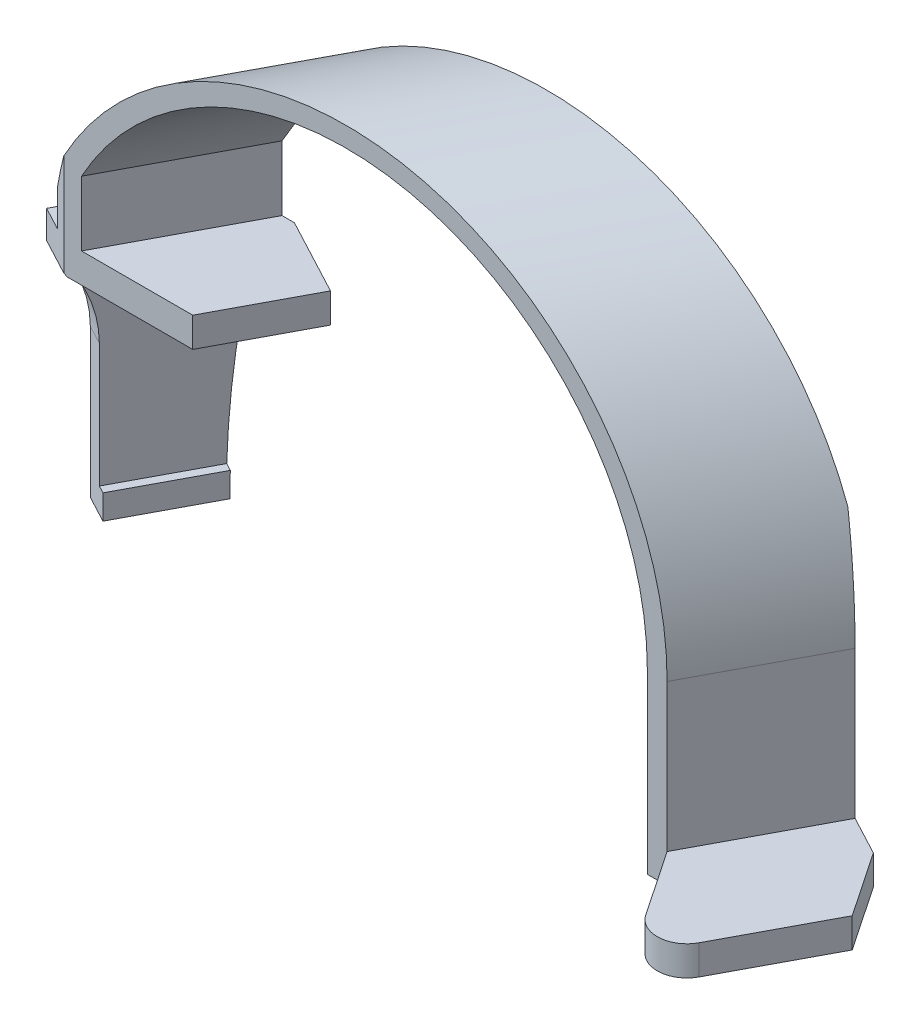
ISO-10303-21;
HEADER;
FILE_DESCRIPTION(('STEP AP214'),'2;1');
FILE_NAME('part.step','',(''),(''),'','','');
FILE_SCHEMA(('AUTOMOTIVE_DESIGN { 1 0 10303 214 1 1 1 1 }'));
ENDSEC;
DATA;
#1=APPLICATION_CONTEXT('core data for automotive mechanical design processes');
#2=APPLICATION_PROTOCOL_DEFINITION('international standard','automotive_design',2000,#1);
#3=PRODUCT_CONTEXT('',#1,'mechanical');
#4=PRODUCT('Part','Part','',(#3));
#5=PRODUCT_RELATED_PRODUCT_CATEGORY('part','',(#4));
#6=PRODUCT_DEFINITION_FORMATION('','',#4);
#7=PRODUCT_DEFINITION_CONTEXT('part definition',#1,'design');
#8=PRODUCT_DEFINITION('design','',#6,#7);
#9=PRODUCT_DEFINITION_SHAPE('','',#8);
#10=(LENGTH_UNIT() NAMED_UNIT(*) SI_UNIT(.MILLI.,.METRE.));
#11=(NAMED_UNIT(*) PLANE_ANGLE_UNIT() SI_UNIT($,.RADIAN.));
#12=(NAMED_UNIT(*) SI_UNIT($,.STERADIAN.) SOLID_ANGLE_UNIT());
#13=UNCERTAINTY_MEASURE_WITH_UNIT(LENGTH_MEASURE(1.E-05),#10,'distance_accuracy_value','');
#14=(GEOMETRIC_REPRESENTATION_CONTEXT(3) GLOBAL_UNCERTAINTY_ASSIGNED_CONTEXT((#13)) GLOBAL_UNIT_ASSIGNED_CONTEXT((#10,
#11,#12)) REPRESENTATION_CONTEXT('',''));
#15=CARTESIAN_POINT('',(0.,0.,0.));
#16=DIRECTION('',(0.,0.,1.));
#17=DIRECTION('',(1.,0.,0.));
#18=AXIS2_PLACEMENT_3D('',#15,#16,#17);
#19=CARTESIAN_POINT('',(-7.04207344178837,0.,13.2442138928839));
#20=DIRECTION('',(0.,0.,1.));
#21=DIRECTION('',(-1.,0.,0.));
#22=AXIS2_PLACEMENT_3D('',#19,#20,#21);
#23=PLANE('',#22);
#24=DIRECTION('',(0.,1.,0.));
#25=VECTOR('',#24,1.);
#26=CARTESIAN_POINT('',(25.4579265582116,-34.7865111003914,13.2442138928839));
#27=LINE('',#26,#25);
#28=CARTESIAN_POINT('',(25.4579265582116,-17.9,13.2442138928839));
#29=VERTEX_POINT('',#28);
#30=CARTESIAN_POINT('',(25.4579265582116,-14.9,13.2442138928839));
#31=VERTEX_POINT('',#30);
#32=EDGE_CURVE('E217',#29,#31,#27,.T.);
#33=ORIENTED_EDGE('',*,*,#32,.T.);
#34=DIRECTION('',(0.,1.,0.));
#35=VECTOR('',#34,1.);
#36=CARTESIAN_POINT('',(25.4579265582116,-14.9,13.2442138928839));
#37=LINE('',#36,#35);
#38=CARTESIAN_POINT('',(25.4579265582116,0.,13.2442138928839));
#39=VERTEX_POINT('',#38);
#40=EDGE_CURVE('E230',#31,#39,#37,.T.);
#41=ORIENTED_EDGE('',*,*,#40,.T.);
#42=CARTESIAN_POINT('',(-7.04207344178837,0.,13.2442138928839));
#43=DIRECTION('',(0.,0.,1.));
#44=DIRECTION('',(-1.,0.,0.));
#45=AXIS2_PLACEMENT_3D('',#42,#43,#44);
#46=CIRCLE('',#45,32.5);
#47=CARTESIAN_POINT('',(-35.5880298672367,15.5363564504811,13.2442138928839));
#48=VERTEX_POINT('',#47);
#49=EDGE_CURVE('E423',#39,#48,#46,.T.);
#50=ORIENTED_EDGE('',*,*,#49,.T.);
#51=DIRECTION('',(0.,1.,0.));
#52=VECTOR('',#51,1.);
#53=CARTESIAN_POINT('',(-35.5880298672367,0.,13.2442138928839));
#54=LINE('',#53,#52);
#55=CARTESIAN_POINT('',(-35.5880298672367,5.26788060441782,13.2442138928839));
#56=VERTEX_POINT('',#55);
#57=EDGE_CURVE('E263',#56,#48,#54,.T.);
#58=ORIENTED_EDGE('',*,*,#57,.F.);
#59=CARTESIAN_POINT('',(-53.8485551832628,-2.90000000000001,13.2442138928839));
#60=DIRECTION('',(0.,0.,-1.));
#61=DIRECTION('',(-1.,0.,0.));
#62=AXIS2_PLACEMENT_3D('',#59,#60,#61);
#63=ELLIPSE('',#62,25.2217813165167,11.8409090909091);
#64=CARTESIAN_POINT('',(-35.2538838395383,5.1,13.2442138928839));
#65=VERTEX_POINT('',#64);
#66=EDGE_CURVE('E497',#56,#65,#63,.T.);
#67=ORIENTED_EDGE('',*,*,#66,.T.);
#68=DIRECTION('',(1.,0.,0.));
#69=VECTOR('',#68,1.);
#70=CARTESIAN_POINT('',(-37.8420734417884,5.1,13.2442138928839));
#71=LINE('',#70,#69);
#72=CARTESIAN_POINT('',(-33.7920734417884,5.1,13.2442138928839));
#73=VERTEX_POINT('',#72);
#74=EDGE_CURVE('E521',#65,#73,#71,.T.);
#75=ORIENTED_EDGE('',*,*,#74,.T.);
#76=DIRECTION('',(1.,0.,0.));
#77=VECTOR('',#76,1.);
#78=CARTESIAN_POINT('',(-33.7920734417884,5.1,13.2442138928839));
#79=LINE('',#78,#77);
#80=CARTESIAN_POINT('',(-22.5420734417884,5.1,13.2442138928839));
#81=VERTEX_POINT('',#80);
#82=EDGE_CURVE('E529',#73,#81,#79,.T.);
#83=ORIENTED_EDGE('',*,*,#82,.T.);
#84=DIRECTION('',(0.,1.,0.));
#85=VECTOR('',#84,1.);
#86=CARTESIAN_POINT('',(-22.5420734417884,5.1,13.2442138928839));
#87=LINE('',#86,#85);
#88=CARTESIAN_POINT('',(-22.5420734417884,8.1,13.2442138928839));
#89=VERTEX_POINT('',#88);
#90=EDGE_CURVE('E537',#81,#89,#87,.T.);
#91=ORIENTED_EDGE('',*,*,#90,.T.);
#92=DIRECTION('',(-1.,0.,0.));
#93=VECTOR('',#92,1.);
#94=CARTESIAN_POINT('',(-22.5420734417884,8.1,13.2442138928839));
#95=LINE('',#94,#93);
#96=CARTESIAN_POINT('',(-33.7920734417884,8.09999999999999,13.2442138928839));
#97=VERTEX_POINT('',#96);
#98=EDGE_CURVE('E542',#89,#97,#95,.T.);
#99=ORIENTED_EDGE('',*,*,#98,.T.);
#100=DIRECTION('',(0.,1.,0.));
#101=VECTOR('',#100,1.);
#102=CARTESIAN_POINT('',(-33.7920734417884,8.09999999999999,13.2442138928839));
#103=LINE('',#102,#101);
#104=CARTESIAN_POINT('',(-33.7920734417884,14.6522182620926,13.2442138928839));
#105=VERTEX_POINT('',#104);
#106=EDGE_CURVE('E550',#97,#105,#103,.T.);
#107=ORIENTED_EDGE('',*,*,#106,.T.);
#108=CARTESIAN_POINT('',(-7.04207344178837,0.,13.2442138928839));
#109=DIRECTION('',(0.,0.,-1.));
#110=DIRECTION('',(-1.,0.,0.));
#111=AXIS2_PLACEMENT_3D('',#108,#109,#110);
#112=CIRCLE('',#111,30.5);
#113=CARTESIAN_POINT('',(23.4579265582116,0.,13.2442138928839));
#114=VERTEX_POINT('',#113);
#115=EDGE_CURVE('E558',#105,#114,#112,.T.);
#116=ORIENTED_EDGE('',*,*,#115,.T.);
#117=DIRECTION('',(0.,-1.,0.));
#118=VECTOR('',#117,1.);
#119=CARTESIAN_POINT('',(23.4579265582116,0.,13.2442138928839));
#120=LINE('',#119,#118);
#121=CARTESIAN_POINT('',(23.4579265582116,-17.9,13.2442138928839));
#122=VERTEX_POINT('',#121);
#123=EDGE_CURVE('E565',#114,#122,#120,.T.);
#124=ORIENTED_EDGE('',*,*,#123,.T.);
#125=DIRECTION('',(1.,0.,0.));
#126=VECTOR('',#125,1.);
#127=CARTESIAN_POINT('',(38.4579265582116,-17.9,13.2442138928839));
#128=LINE('',#127,#126);
#129=EDGE_CURVE('E244',#122,#29,#128,.T.);
#130=ORIENTED_EDGE('',*,*,#129,.T.);
#131=EDGE_LOOP('',(#33,#41,#50,#58,#67,#75,#83,#91,#99,#107,#116,#124,#130));
#132=FACE_BOUND('',#131,.T.);
#133=ADVANCED_FACE('F35',(#132),#23,.T.);
#134=CARTESIAN_POINT('',(32.5,0.,0.));
#135=CARTESIAN_POINT('',(25.4579265582116,0.,13.2442138928839));
#136=CARTESIAN_POINT('',(32.5,46.5453658776146,0.));
#137=CARTESIAN_POINT('',(25.4579265582116,46.5453658776146,13.2442138928839));
#138=CARTESIAN_POINT('',(-13.2326781943357,55.2052290320959,0.));
#139=CARTESIAN_POINT('',(-20.274751636124,55.2052290320959,13.2442138928839));
#140=CARTESIAN_POINT('',(-30.25,11.8822346383162,0.));
#141=CARTESIAN_POINT('',(-37.2920734417884,11.8822346383162,13.2442138928839));
#142=(BOUNDED_SURFACE() B_SPLINE_SURFACE(3,1,((#134,#135),(#136,#137),(#138,#139),(#140,#141)),
.UNSPECIFIED.,.F.,.F.,.F.) B_SPLINE_SURFACE_WITH_KNOTS((4,4),(2,2),(0.,1.),(0.,1.),
.UNSPECIFIED.) GEOMETRIC_REPRESENTATION_ITEM() RATIONAL_B_SPLINE_SURFACE(((1.,1.),
(0.457368067922542,0.457368067922542),(0.457368067922542,0.457368067922542),(1.,1.))) REPRESENTATION_ITEM('') SURFACE());
#143=CARTESIAN_POINT('',(-36.9164961915597,11.8822346383162,12.5378558185968));
#144=CARTESIAN_POINT('',(-36.8687982856735,12.0379949890474,12.5632172450269));
#145=CARTESIAN_POINT('',(-36.8201339475619,12.1933758630278,12.5890925325864));
#146=CARTESIAN_POINT('',(-36.720905244315,12.5032509034758,12.6418533699943));
#147=CARTESIAN_POINT('',(-36.6703420481109,12.6577455500996,12.668738298311));
#148=CARTESIAN_POINT('',(-36.5673116330772,12.9658464892543,12.7235205417324));
#149=CARTESIAN_POINT('',(-36.514845197407,13.1194531176933,12.7514174404239));
#150=CARTESIAN_POINT('',(-36.4080029551091,13.4257757019607,12.8082264683536));
#151=CARTESIAN_POINT('',(-36.3536275438921,13.5784918346865,12.8371383873482));
#152=CARTESIAN_POINT('',(-36.242960069378,13.8830318573129,12.8959813273255));
#153=CARTESIAN_POINT('',(-36.1866679941199,14.0348557416385,12.925912354668));
#154=CARTESIAN_POINT('',(-36.0721595520628,14.3376059722232,12.9867975733146));
#155=CARTESIAN_POINT('',(-36.0139428008037,14.4885321319677,13.0177519690398));
#156=CARTESIAN_POINT('',(-35.8955755034144,14.7894821608153,13.0806889774619));
#157=CARTESIAN_POINT('',(-35.835424181289,14.9395056384545,13.1126720027629));
#158=CARTESIAN_POINT('',(-35.7131768580037,15.2386447351217,13.177672057549));
#159=CARTESIAN_POINT('',(-35.6510796845373,15.3877597396114,13.2106897103606));
#160=CARTESIAN_POINT('',(-35.5880298672367,15.5363564504811,13.2442138928839));
#161=B_SPLINE_CURVE_WITH_KNOTS('',3,(#143,#144,#145,#146,#147,#148,#149,#150,#151,#152,#153,
#154,#155,#156,#157,#158,#159,#160),.UNSPECIFIED.,.F.,.F.,(4,2,2,2,2,2,2,2,4),(0.,
0.494583032251077,0.988866437212226,1.48294870785065,1.97692923492772,2.4709128452541,
2.96499573373384,3.45927934315677,3.95386669383938),.UNSPECIFIED.);
#162=CARTESIAN_POINT('',(-36.9164961915597,11.8822346383162,12.5378558185968));
#163=VERTEX_POINT('',#162);
#164=EDGE_CURVE('E255',#163,#48,#161,.T.);
#165=DIRECTION('',(-0.469471562785892,0.,0.882947592858926));
#166=VECTOR('',#165,1.);
#167=CARTESIAN_POINT('',(32.5,0.,0.));
#168=LINE('',#167,#166);
#169=CARTESIAN_POINT('',(32.0591929034708,0.,0.829037572555032));
#170=VERTEX_POINT('',#169);
#171=EDGE_CURVE('E236',#170,#39,#168,.T.);
#172=CARTESIAN_POINT('',(30.5,11.2249721603217,0.));
#173=CARTESIAN_POINT('',(30.5870300877948,10.9216438047626,0.0462747185188256));
#174=CARTESIAN_POINT('',(30.6704364276544,10.6169834846295,0.0906226560825374));
#175=CARTESIAN_POINT('',(30.8297133460518,10.0062889779655,0.175311695840425));
#176=CARTESIAN_POINT('',(30.9056089310888,9.70026315792595,0.215666094226057));
#177=CARTESIAN_POINT('',(31.0499792206244,9.08687043789797,0.292429138823825));
#178=CARTESIAN_POINT('',(31.1184736321463,8.77950948571191,0.328848263446127));
#179=CARTESIAN_POINT('',(31.2481363209366,8.16347236743959,0.397791138010515));
#180=CARTESIAN_POINT('',(31.309319207014,7.85480014475877,0.430322655594131));
#181=CARTESIAN_POINT('',(31.4244337380131,7.23616096360021,0.491530137447629));
#182=CARTESIAN_POINT('',(31.4783750436956,6.92619631049452,0.520211238435138));
#183=CARTESIAN_POINT('',(31.5790624388578,6.3049872616726,0.573747676092342));
#184=CARTESIAN_POINT('',(31.6258133405621,5.9937438662515,0.59860557146719));
#185=CARTESIAN_POINT('',(31.712154736267,5.37000739693937,0.644514105906288));
#186=CARTESIAN_POINT('',(31.7517457115576,5.05751440849034,0.66556500087697));
#187=CARTESIAN_POINT('',(31.8237919419099,4.43125077131639,0.703872661070926));
#188=CARTESIAN_POINT('',(31.8562421367813,4.11747937601429,0.721126735743343));
#189=CARTESIAN_POINT('',(31.914007354856,3.48865884379545,0.751841047015646));
#190=CARTESIAN_POINT('',(31.9393124962721,3.17360854265872,0.765296029376087));
#191=CARTESIAN_POINT('',(31.9827697650184,2.54222820401616,0.788402669042736));
#192=CARTESIAN_POINT('',(32.0009071713295,2.22589686698319,0.798046499044231));
#193=CARTESIAN_POINT('',(32.0299926121239,1.59195057334708,0.813511502238647));
#194=CARTESIAN_POINT('',(32.0409210206188,1.27433446187131,0.819322240108433));
#195=CARTESIAN_POINT('',(32.0555335570521,0.63781269376178,0.827091863550531));
#196=CARTESIAN_POINT('',(32.0591930396647,0.318906311124735,0.829037644970639));
#197=CARTESIAN_POINT('',(32.0591929034708,0.,0.829037572555029));
#198=B_SPLINE_CURVE_WITH_KNOTS('',3,(#172,#173,#174,#175,#176,#177,#178,#179,#180,#181,#182,
#183,#184,#185,#186,#187,#188,#189,#190,#191,#192,#193,#194,#195,#196,#197),.UNSPECIFIED.,.F.,
.F.,(4,2,2,2,2,2,2,2,2,2,2,2,4),(0.,0.956792913563713,1.91028477245361,2.86117173935745,
3.81012584023216,4.75780111745014,5.70483937084619,6.65181394068355,7.59945742195184,
8.54840516897329,9.49929185052377,10.4527566859828,11.4094487674815),.UNSPECIFIED.);
#199=CARTESIAN_POINT('',(30.5,11.2249721603218,0.));
#200=VERTEX_POINT('',#199);
#201=EDGE_CURVE('E287',#200,#170,#198,.T.);
#202=CARTESIAN_POINT('',(0.,0.,0.));
#203=DIRECTION('',(0.,0.,1.));
#204=DIRECTION('',(-1.,0.,0.));
#205=AXIS2_PLACEMENT_3D('',#202,#203,#204);
#206=CIRCLE('',#205,32.5);
#207=CARTESIAN_POINT('',(-30.25,11.8822346383162,0.));
#208=VERTEX_POINT('',#207);
#209=EDGE_CURVE('E424',#200,#208,#206,.T.);
#210=DIRECTION('',(-0.469471562785892,0.,0.882947592858926));
#211=VECTOR('',#210,1.);
#212=CARTESIAN_POINT('',(-30.25,11.8822346383162,0.));
#213=LINE('',#212,#211);
#214=EDGE_CURVE('E430',#208,#163,#213,.T.);
#215=ORIENTED_EDGE('',*,*,#164,.T.);
#216=ORIENTED_EDGE('',*,*,#49,.F.);
#217=ORIENTED_EDGE('',*,*,#171,.F.);
#218=ORIENTED_EDGE('',*,*,#201,.F.);
#219=ORIENTED_EDGE('',*,*,#209,.T.);
#220=ORIENTED_EDGE('',*,*,#214,.T.);
#221=EDGE_LOOP('',(#215,#216,#217,#218,#219,#220));
#222=FACE_BOUND('',#221,.T.);
#223=ADVANCED_FACE('F269',(#222),#142,.T.);
#224=CARTESIAN_POINT('',(-30.25,8.09999999999999,0.));
#225=DIRECTION('',(0.882947592858927,0.,0.469471562785892));
#226=DIRECTION('',(-0.469471562785892,0.,0.882947592858927));
#227=AXIS2_PLACEMENT_3D('',#224,#225,#226);
#228=PLANE('',#227);
#229=DIRECTION('',(0.,1.,0.));
#230=VECTOR('',#229,1.);
#231=CARTESIAN_POINT('',(-36.9164961915597,8.09999999999999,12.5378558185968));
#232=LINE('',#231,#230);
#233=CARTESIAN_POINT('',(-36.9164961915597,8.09999999999999,12.5378558185967));
#234=VERTEX_POINT('',#233);
#235=EDGE_CURVE('E253',#234,#163,#232,.T.);
#236=ORIENTED_EDGE('',*,*,#235,.T.);
#237=ORIENTED_EDGE('',*,*,#214,.F.);
#238=DIRECTION('',(0.,-1.,0.));
#239=VECTOR('',#238,1.);
#240=CARTESIAN_POINT('',(-30.25,8.09999999999999,0.));
#241=LINE('',#240,#239);
#242=CARTESIAN_POINT('',(-30.25,8.09999999999999,0.));
#243=VERTEX_POINT('',#242);
#244=EDGE_CURVE('E427',#208,#243,#241,.T.);
#245=ORIENTED_EDGE('',*,*,#244,.T.);
#246=DIRECTION('',(-0.469471562785892,0.,0.882947592858926));
#247=VECTOR('',#246,1.);
#248=CARTESIAN_POINT('',(-30.25,8.09999999999999,0.));
#249=LINE('',#248,#247);
#250=EDGE_CURVE('E433',#243,#234,#249,.T.);
#251=ORIENTED_EDGE('',*,*,#250,.T.);
#252=EDGE_LOOP('',(#236,#237,#245,#251));
#253=FACE_BOUND('',#252,.T.);
#254=ADVANCED_FACE('F276',(#253),#228,.F.);
#255=CARTESIAN_POINT('',(-33.3,8.1,0.));
#256=DIRECTION('',(0.,-1.,0.));
#257=DIRECTION('',(1.,0.,0.));
#258=AXIS2_PLACEMENT_3D('',#255,#256,#257);
#259=PLANE('',#258);
#260=DIRECTION('',(0.882947592858927,0.,0.469471562785891));
#261=VECTOR('',#260,1.);
#262=CARTESIAN_POINT('',(-39.2942653693525,8.1,11.2735735204503));
#263=LINE('',#262,#261);
#264=CARTESIAN_POINT('',(-39.2942653693525,8.09999999999999,11.2735735204503));
#265=VERTEX_POINT('',#264);
#266=EDGE_CURVE('E251',#265,#234,#263,.T.);
#267=ORIENTED_EDGE('',*,*,#266,.T.);
#268=ORIENTED_EDGE('',*,*,#250,.F.);
#269=DIRECTION('',(-1.,0.,0.));
#270=VECTOR('',#269,1.);
#271=CARTESIAN_POINT('',(-33.3,8.1,0.));
#272=LINE('',#271,#270);
#273=CARTESIAN_POINT('',(-33.3,8.1,0.));
#274=VERTEX_POINT('',#273);
#275=EDGE_CURVE('E436',#243,#274,#272,.T.);
#276=ORIENTED_EDGE('',*,*,#275,.T.);
#277=DIRECTION('',(-0.469471562785892,0.,0.882947592858926));
#278=VECTOR('',#277,1.);
#279=CARTESIAN_POINT('',(-33.3,8.1,0.));
#280=LINE('',#279,#278);
#281=EDGE_CURVE('E439',#274,#265,#280,.T.);
#282=ORIENTED_EDGE('',*,*,#281,.T.);
#283=EDGE_LOOP('',(#267,#268,#276,#282));
#284=FACE_BOUND('',#283,.T.);
#285=ADVANCED_FACE('F596',(#284),#259,.F.);
#286=CARTESIAN_POINT('',(-33.3,-17.9,0.));
#287=DIRECTION('',(0.882947592858927,0.,0.469471562785892));
#288=DIRECTION('',(-0.469471562785892,0.,0.882947592858927));
#289=AXIS2_PLACEMENT_3D('',#286,#287,#288);
#290=PLANE('',#289);
#291=DIRECTION('',(0.,1.,0.));
#292=VECTOR('',#291,1.);
#293=CARTESIAN_POINT('',(-39.2942653693525,-17.9,11.2735735204503));
#294=LINE('',#293,#292);
#295=CARTESIAN_POINT('',(-39.2942653693525,5.26788060441782,11.2735735204503));
#296=VERTEX_POINT('',#295);
#297=EDGE_CURVE('E247',#296,#265,#294,.T.);
#298=ORIENTED_EDGE('',*,*,#297,.T.);
#299=ORIENTED_EDGE('',*,*,#281,.F.);
#300=DIRECTION('',(0.,-1.,0.));
#301=VECTOR('',#300,1.);
#302=CARTESIAN_POINT('',(-33.3,-17.9,0.));
#303=LINE('',#302,#301);
#304=CARTESIAN_POINT('',(-33.3,-17.9,0.));
#305=VERTEX_POINT('',#304);
#306=EDGE_CURVE('E442',#274,#305,#303,.T.);
#307=ORIENTED_EDGE('',*,*,#306,.T.);
#308=DIRECTION('',(-0.469471562785892,0.,0.882947592858926));
#309=VECTOR('',#308,1.);
#310=CARTESIAN_POINT('',(-33.3,-17.9,0.));
#311=LINE('',#310,#309);
#312=CARTESIAN_POINT('',(-37.759979846466,-17.9,8.38800213215979));
#313=VERTEX_POINT('',#312);
#314=EDGE_CURVE('E445',#305,#313,#311,.T.);
#315=ORIENTED_EDGE('',*,*,#314,.T.);
#316=DIRECTION('',(0.,1.,0.));
#317=VECTOR('',#316,1.);
#318=CARTESIAN_POINT('',(-37.759979846466,-17.9,8.38800213215979));
#319=LINE('',#318,#317);
#320=CARTESIAN_POINT('',(-37.759979846466,-2.9,8.3880021321598));
#321=VERTEX_POINT('',#320);
#322=EDGE_CURVE('E468',#313,#321,#319,.T.);
#323=ORIENTED_EDGE('',*,*,#322,.T.);
#324=CARTESIAN_POINT('',(-43.3189499421807,-2.90000000000001,18.8429043112394));
#325=DIRECTION('',(0.882947592858926,0.,0.469471562785892));
#326=DIRECTION('',(0.469471562785892,0.,-0.882947592858926));
#327=AXIS2_PLACEMENT_3D('',#324,#325,#326);
#328=CIRCLE('',#327,11.8409090909091);
#329=EDGE_CURVE('E470',#321,#296,#328,.T.);
#330=ORIENTED_EDGE('',*,*,#329,.T.);
#331=EDGE_LOOP('',(#298,#299,#307,#315,#323,#330));
#332=FACE_BOUND('',#331,.T.);
#333=ADVANCED_FACE('F586',(#332),#290,.F.);
#334=CARTESIAN_POINT('',(21.0258385599899,-2.90000000000001,53.0556352361067));
#335=DIRECTION('',(-0.882947592858927,0.,-0.469471562785892));
#336=DIRECTION('',(0.469471562785892,0.,-0.882947592858927));
#337=AXIS2_PLACEMENT_3D('',#334,#335,#336);
#338=CYLINDRICAL_SURFACE('',#337,11.8409090909091);
#339=DIRECTION('',(-0.882947592858927,0.,-0.469471562785892));
#340=VECTOR('',#339,1.);
#341=CARTESIAN_POINT('',(25.0505231328181,5.26788060441782,45.4863044453176));
#342=LINE('',#341,#340);
#343=EDGE_CURVE('E407',#56,#296,#342,.T.);
#344=ORIENTED_EDGE('',*,*,#343,.T.);
#345=ORIENTED_EDGE('',*,*,#329,.F.);
#346=DIRECTION('',(-0.882947592858927,0.,-0.469471562785892));
#347=VECTOR('',#346,1.);
#348=CARTESIAN_POINT('',(26.5848086557047,-2.9,42.6007330570271));
#349=LINE('',#348,#347);
#350=CARTESIAN_POINT('',(-35.8109887171276,-2.9,9.4242990978536));
#351=VERTEX_POINT('',#350);
#352=EDGE_CURVE('E469',#351,#321,#349,.T.);
#353=ORIENTED_EDGE('',*,*,#352,.F.);
#354=CARTESIAN_POINT('',(-41.3699588128423,-2.90000000000001,19.8792012769332));
#355=DIRECTION('',(0.882947592858926,0.,0.469471562785892));
#356=DIRECTION('',(0.469471562785892,0.,-0.882947592858927));
#357=AXIS2_PLACEMENT_3D('',#354,#355,#356);
#358=CIRCLE('',#357,11.8409090909091);
#359=CARTESIAN_POINT('',(-37.2716272698708,5.1,12.1713606803031));
#360=VERTEX_POINT('',#359);
#361=EDGE_CURVE('E494',#351,#360,#358,.T.);
#362=ORIENTED_EDGE('',*,*,#361,.T.);
#363=DIRECTION('',(-0.882947592858927,0.,-0.469471562785892));
#364=VECTOR('',#363,1.);
#365=CARTESIAN_POINT('',(25.1241701029614,5.1,45.3477946394766));
#366=LINE('',#365,#364);
#367=EDGE_CURVE('E492',#360,#65,#366,.F.);
#368=ORIENTED_EDGE('',*,*,#367,.T.);
#369=ORIENTED_EDGE('',*,*,#66,.F.);
#370=EDGE_LOOP('',(#344,#345,#353,#362,#368,#369));
#371=FACE_BOUND('',#370,.T.);
#372=ADVANCED_FACE('F378',(#371),#338,.F.);
#373=CARTESIAN_POINT('',(0.,0.,0.));
#374=DIRECTION('',(0.,0.,1.));
#375=DIRECTION('',(-1.,0.,0.));
#376=AXIS2_PLACEMENT_3D('',#373,#374,#375);
#377=PLANE('',#376);
#378=DIRECTION('',(1.,0.,0.));
#379=VECTOR('',#378,1.);
#380=CARTESIAN_POINT('',(-26.75,5.1,0.));
#381=LINE('',#380,#379);
#382=CARTESIAN_POINT('',(-26.75,5.1,0.));
#383=VERTEX_POINT('',#382);
#384=CARTESIAN_POINT('',(-25.5000000000001,5.1,0.));
#385=VERTEX_POINT('',#384);
#386=EDGE_CURVE('E524',#383,#385,#381,.T.);
#387=ORIENTED_EDGE('',*,*,#386,.F.);
#388=DIRECTION('',(1.,0.,0.));
#389=VECTOR('',#388,1.);
#390=CARTESIAN_POINT('',(-30.8,5.1,0.));
#391=LINE('',#390,#389);
#392=CARTESIAN_POINT('',(-30.8,5.1,0.));
#393=VERTEX_POINT('',#392);
#394=EDGE_CURVE('E519',#393,#383,#391,.T.);
#395=ORIENTED_EDGE('',*,*,#394,.F.);
#396=DIRECTION('',(0.,1.,0.));
#397=VECTOR('',#396,1.);
#398=CARTESIAN_POINT('',(-30.8,-15.4161392660939,0.));
#399=LINE('',#398,#397);
#400=CARTESIAN_POINT('',(-30.8,-2.26742597606738,0.));
#401=VERTEX_POINT('',#400);
#402=EDGE_CURVE('E508',#401,#393,#399,.T.);
#403=ORIENTED_EDGE('',*,*,#402,.F.);
#404=CARTESIAN_POINT('',(189.704479488069,-17.9,0.));
#405=DIRECTION('',(0.,0.,-1.));
#406=DIRECTION('',(-1.,0.,0.));
#407=AXIS2_PLACEMENT_3D('',#404,#405,#406);
#408=ELLIPSE('',#407,223.004479488069,104.694261493518);
#409=EDGE_CURVE('E489',#305,#401,#408,.T.);
#410=ORIENTED_EDGE('',*,*,#409,.F.);
#411=ORIENTED_EDGE('',*,*,#306,.F.);
#412=ORIENTED_EDGE('',*,*,#275,.F.);
#413=ORIENTED_EDGE('',*,*,#244,.F.);
#414=ORIENTED_EDGE('',*,*,#209,.F.);
#415=DIRECTION('',(0.,-1.,0.));
#416=VECTOR('',#415,1.);
#417=CARTESIAN_POINT('',(30.5,32.5,0.));
#418=LINE('',#417,#416);
#419=CARTESIAN_POINT('',(30.5,0.,0.));
#420=VERTEX_POINT('',#419);
#421=EDGE_CURVE('E502',#200,#420,#418,.T.);
#422=ORIENTED_EDGE('',*,*,#421,.T.);
#423=CARTESIAN_POINT('',(0.,0.,0.));
#424=DIRECTION('',(0.,0.,-1.));
#425=DIRECTION('',(-1.,0.,0.));
#426=AXIS2_PLACEMENT_3D('',#423,#424,#425);
#427=CIRCLE('',#426,30.5);
#428=CARTESIAN_POINT('',(-26.75,14.6522182620926,0.));
#429=VERTEX_POINT('',#428);
#430=EDGE_CURVE('E553',#429,#420,#427,.T.);
#431=ORIENTED_EDGE('',*,*,#430,.F.);
#432=DIRECTION('',(0.,1.,0.));
#433=VECTOR('',#432,1.);
#434=CARTESIAN_POINT('',(-26.75,8.09999999999999,0.));
#435=LINE('',#434,#433);
#436=CARTESIAN_POINT('',(-26.75,8.09999999999999,0.));
#437=VERTEX_POINT('',#436);
#438=EDGE_CURVE('E545',#437,#429,#435,.T.);
#439=ORIENTED_EDGE('',*,*,#438,.F.);
#440=DIRECTION('',(-1.,0.,0.));
#441=VECTOR('',#440,1.);
#442=CARTESIAN_POINT('',(-15.5,8.1,0.));
#443=LINE('',#442,#441);
#444=CARTESIAN_POINT('',(-25.5000000000001,8.09999999999999,0.));
#445=VERTEX_POINT('',#444);
#446=EDGE_CURVE('E532',#445,#437,#443,.T.);
#447=ORIENTED_EDGE('',*,*,#446,.F.);
#448=DIRECTION('',(0.,1.,0.));
#449=VECTOR('',#448,1.);
#450=CARTESIAN_POINT('',(-25.5000000000001,0.,0.));
#451=LINE('',#450,#449);
#452=EDGE_CURVE('E606',#385,#445,#451,.T.);
#453=ORIENTED_EDGE('',*,*,#452,.F.);
#454=EDGE_LOOP('',(#387,#395,#403,#410,#411,#412,#413,#414,#422,#431,#439,#447,#453));
#455=FACE_BOUND('',#454,.T.);
#456=ADVANCED_FACE('F313',(#455),#377,.F.);
#457=CARTESIAN_POINT('',(-29.8,-17.9,0.));
#458=DIRECTION('',(-0.882947592858926,0.,-0.469471562785892));
#459=DIRECTION('',(0.469471562785892,0.,-0.882947592858927));
#460=AXIS2_PLACEMENT_3D('',#457,#458,#459);
#461=PLANE('',#460);
#462=DIRECTION('',(-0.469471562785892,0.,0.882947592858926));
#463=VECTOR('',#462,1.);
#464=CARTESIAN_POINT('',(-29.8,-15.4161392660939,0.));
#465=LINE('',#464,#463);
#466=CARTESIAN_POINT('',(-30.557577646255,-15.4161392660939,1.42479632886655));
#467=VERTEX_POINT('',#466);
#468=CARTESIAN_POINT('',(-35.0313922653922,-15.4161392660939,9.83881788413113));
#469=VERTEX_POINT('',#468);
#470=EDGE_CURVE('E509',#467,#469,#465,.T.);
#471=ORIENTED_EDGE('',*,*,#470,.T.);
#472=DIRECTION('',(0.,1.,0.));
#473=VECTOR('',#472,1.);
#474=CARTESIAN_POINT('',(-35.0313922653922,-17.9,9.83881788413113));
#475=LINE('',#474,#473);
#476=CARTESIAN_POINT('',(-35.0313922653922,-17.9,9.83881788413113));
#477=VERTEX_POINT('',#476);
#478=EDGE_CURVE('E481',#477,#469,#475,.T.);
#479=ORIENTED_EDGE('',*,*,#478,.F.);
#480=DIRECTION('',(-0.469471562785892,0.,0.882947592858926));
#481=VECTOR('',#480,1.);
#482=CARTESIAN_POINT('',(-29.8,-17.9,0.));
#483=LINE('',#482,#481);
#484=CARTESIAN_POINT('',(-30.5714124189262,-17.9,1.45081575197132));
#485=VERTEX_POINT('',#484);
#486=EDGE_CURVE('E447',#485,#477,#483,.T.);
#487=ORIENTED_EDGE('',*,*,#486,.F.);
#488=CARTESIAN_POINT('',(18.5795661391506,-17.9,-90.9887304198736));
#489=DIRECTION('',(0.882947592858926,0.,0.469471562785892));
#490=DIRECTION('',(0.469471562785892,0.,-0.882947592858927));
#491=AXIS2_PLACEMENT_3D('',#488,#489,#490);
#492=CIRCLE('',#491,104.694261493518);
#493=EDGE_CURVE('E487',#467,#485,#492,.T.);
#494=ORIENTED_EDGE('',*,*,#493,.F.);
#495=EDGE_LOOP('',(#471,#479,#487,#494));
#496=FACE_BOUND('',#495,.T.);
#497=ADVANCED_FACE('F309',(#496),#461,.F.);
#498=CARTESIAN_POINT('',(-29.8,-15.4161392660939,0.));
#499=DIRECTION('',(0.,-1.,0.));
#500=DIRECTION('',(0.,0.,1.));
#501=AXIS2_PLACEMENT_3D('',#498,#499,#500);
#502=PLANE('',#501);
#503=DIRECTION('',(-0.469471562785892,0.,0.882947592858926));
#504=VECTOR('',#503,1.);
#505=CARTESIAN_POINT('',(-30.8,-15.4161392660939,0.));
#506=LINE('',#505,#504);
#507=CARTESIAN_POINT('',(-31.3371740979903,-15.4161392660939,1.01027754258902));
#508=VERTEX_POINT('',#507);
#509=CARTESIAN_POINT('',(-35.8109887171275,-15.4161392660939,9.42429909785361));
#510=VERTEX_POINT('',#509);
#511=EDGE_CURVE('E512',#508,#510,#506,.T.);
#512=ORIENTED_EDGE('',*,*,#511,.T.);
#513=DIRECTION('',(-0.882947592858927,0.,-0.469471562785892));
#514=VECTOR('',#513,1.);
#515=CARTESIAN_POINT('',(-35.0313922653922,-15.4161392660939,9.83881788413113));
#516=LINE('',#515,#514);
#517=EDGE_CURVE('E478',#469,#510,#516,.T.);
#518=ORIENTED_EDGE('',*,*,#517,.F.);
#519=ORIENTED_EDGE('',*,*,#470,.F.);
#520=DIRECTION('',(-0.882947592858927,0.,-0.469471562785892));
#521=VECTOR('',#520,1.);
#522=CARTESIAN_POINT('',(31.0586232748419,-15.4161392660939,34.1867115017625));
#523=LINE('',#522,#521);
#524=EDGE_CURVE('E485',#508,#467,#523,.F.);
#525=ORIENTED_EDGE('',*,*,#524,.F.);
#526=EDGE_LOOP('',(#512,#518,#519,#525));
#527=FACE_BOUND('',#526,.T.);
#528=ADVANCED_FACE('F312',(#527),#502,.F.);
#529=CARTESIAN_POINT('',(-30.8,-15.4161392660939,0.));
#530=DIRECTION('',(-0.882947592858926,0.,-0.469471562785892));
#531=DIRECTION('',(0.469471562785892,0.,-0.882947592858927));
#532=AXIS2_PLACEMENT_3D('',#529,#530,#531);
#533=PLANE('',#532);
#534=ORIENTED_EDGE('',*,*,#402,.T.);
#535=DIRECTION('',(-0.469471562785892,0.,0.882947592858926));
#536=VECTOR('',#535,1.);
#537=CARTESIAN_POINT('',(-30.8,5.1,0.));
#538=LINE('',#537,#536);
#539=EDGE_CURVE('E516',#393,#360,#538,.T.);
#540=ORIENTED_EDGE('',*,*,#539,.T.);
#541=ORIENTED_EDGE('',*,*,#361,.F.);
#542=DIRECTION('',(0.,1.,0.));
#543=VECTOR('',#542,1.);
#544=CARTESIAN_POINT('',(-35.8109887171275,-15.4161392660939,9.42429909785361));
#545=LINE('',#544,#543);
#546=EDGE_CURVE('E472',#510,#351,#545,.T.);
#547=ORIENTED_EDGE('',*,*,#546,.F.);
#548=ORIENTED_EDGE('',*,*,#511,.F.);
#549=CARTESIAN_POINT('',(17.7999696874152,-17.9,-91.4032492061511));
#550=DIRECTION('',(0.882947592858926,0.,0.469471562785892));
#551=DIRECTION('',(0.469471562785892,0.,-0.882947592858927));
#552=AXIS2_PLACEMENT_3D('',#549,#550,#551);
#553=CIRCLE('',#552,104.694261493518);
#554=EDGE_CURVE('E483',#401,#508,#553,.T.);
#555=ORIENTED_EDGE('',*,*,#554,.F.);
#556=EDGE_LOOP('',(#534,#540,#541,#547,#548,#555));
#557=FACE_BOUND('',#556,.T.);
#558=ADVANCED_FACE('F317',(#557),#533,.F.);
#559=CARTESIAN_POINT('',(-30.8,5.1,0.));
#560=DIRECTION('',(0.,1.,0.));
#561=DIRECTION('',(0.,0.,-1.));
#562=AXIS2_PLACEMENT_3D('',#559,#560,#561);
#563=PLANE('',#562);
#564=ORIENTED_EDGE('',*,*,#539,.F.);
#565=ORIENTED_EDGE('',*,*,#394,.T.);
#566=DIRECTION('',(-0.469471562785892,0.,0.882947592858926));
#567=VECTOR('',#566,1.);
#568=CARTESIAN_POINT('',(-26.75,5.1,0.));
#569=LINE('',#568,#567);
#570=EDGE_CURVE('E527',#383,#73,#569,.T.);
#571=ORIENTED_EDGE('',*,*,#570,.T.);
#572=ORIENTED_EDGE('',*,*,#74,.F.);
#573=ORIENTED_EDGE('',*,*,#367,.F.);
#574=EDGE_LOOP('',(#564,#565,#571,#572,#573));
#575=FACE_BOUND('',#574,.T.);
#576=ADVANCED_FACE('F321',(#575),#563,.F.);
#577=CARTESIAN_POINT('',(-26.75,5.1,0.));
#578=DIRECTION('',(0.,1.,0.));
#579=DIRECTION('',(0.,0.,-1.));
#580=AXIS2_PLACEMENT_3D('',#577,#578,#579);
#581=PLANE('',#580);
#582=DIRECTION('',(-0.469471562785892,0.,0.882947592858926));
#583=VECTOR('',#582,1.);
#584=CARTESIAN_POINT('',(-15.5,5.1,0.));
#585=LINE('',#584,#583);
#586=CARTESIAN_POINT('',(-17.7040354826463,5.1,4.14518786277525));
#587=VERTEX_POINT('',#586);
#588=EDGE_CURVE('E535',#587,#81,#585,.T.);
#589=ORIENTED_EDGE('',*,*,#588,.T.);
#590=ORIENTED_EDGE('',*,*,#82,.F.);
#591=ORIENTED_EDGE('',*,*,#570,.F.);
#592=ORIENTED_EDGE('',*,*,#386,.T.);
#593=DIRECTION('',(0.882947592858926,0.,0.469471562785893));
#594=VECTOR('',#593,1.);
#595=CARTESIAN_POINT('',(-25.5000000000001,5.1,0.));
#596=LINE('',#595,#594);
#597=EDGE_CURVE('E410',#587,#385,#596,.F.);
#598=ORIENTED_EDGE('',*,*,#597,.F.);
#599=EDGE_LOOP('',(#589,#590,#591,#592,#598));
#600=FACE_BOUND('',#599,.T.);
#601=ADVANCED_FACE('F325',(#600),#581,.F.);
#602=CARTESIAN_POINT('',(-15.5,5.1,0.));
#603=DIRECTION('',(-0.882947592858926,0.,-0.469471562785892));
#604=DIRECTION('',(0.469471562785892,0.,-0.882947592858927));
#605=AXIS2_PLACEMENT_3D('',#602,#603,#604);
#606=PLANE('',#605);
#607=DIRECTION('',(-0.469471562785892,0.,0.882947592858926));
#608=VECTOR('',#607,1.);
#609=CARTESIAN_POINT('',(-15.5,8.1,0.));
#610=LINE('',#609,#608);
#611=CARTESIAN_POINT('',(-17.7040354826463,8.1,4.14518786277525));
#612=VERTEX_POINT('',#611);
#613=EDGE_CURVE('E540',#612,#89,#610,.T.);
#614=ORIENTED_EDGE('',*,*,#613,.T.);
#615=ORIENTED_EDGE('',*,*,#90,.F.);
#616=ORIENTED_EDGE('',*,*,#588,.F.);
#617=DIRECTION('',(0.,-1.,0.));
#618=VECTOR('',#617,1.);
#619=CARTESIAN_POINT('',(-17.7040354826463,5.1,4.14518786277525));
#620=LINE('',#619,#618);
#621=EDGE_CURVE('E612',#612,#587,#620,.T.);
#622=ORIENTED_EDGE('',*,*,#621,.F.);
#623=EDGE_LOOP('',(#614,#615,#616,#622));
#624=FACE_BOUND('',#623,.T.);
#625=ADVANCED_FACE('F329',(#624),#606,.F.);
#626=CARTESIAN_POINT('',(-15.5,8.1,0.));
#627=DIRECTION('',(0.,-1.,0.));
#628=DIRECTION('',(1.,0.,0.));
#629=AXIS2_PLACEMENT_3D('',#626,#627,#628);
#630=PLANE('',#629);
#631=ORIENTED_EDGE('',*,*,#446,.T.);
#632=DIRECTION('',(-0.469471562785892,0.,0.882947592858926));
#633=VECTOR('',#632,1.);
#634=CARTESIAN_POINT('',(-26.75,8.09999999999999,0.));
#635=LINE('',#634,#633);
#636=EDGE_CURVE('E548',#437,#97,#635,.T.);
#637=ORIENTED_EDGE('',*,*,#636,.T.);
#638=ORIENTED_EDGE('',*,*,#98,.F.);
#639=ORIENTED_EDGE('',*,*,#613,.F.);
#640=DIRECTION('',(-0.882947592858926,0.,-0.469471562785893));
#641=VECTOR('',#640,1.);
#642=CARTESIAN_POINT('',(-25.5000000000001,8.09999999999999,0.));
#643=LINE('',#642,#641);
#644=EDGE_CURVE('E608',#445,#612,#643,.F.);
#645=ORIENTED_EDGE('',*,*,#644,.F.);
#646=EDGE_LOOP('',(#631,#637,#638,#639,#645));
#647=FACE_BOUND('',#646,.T.);
#648=ADVANCED_FACE('F333',(#647),#630,.F.);
#649=CARTESIAN_POINT('',(-26.75,8.09999999999999,0.));
#650=DIRECTION('',(-0.882947592858926,0.,-0.469471562785892));
#651=DIRECTION('',(0.469471562785892,0.,-0.882947592858927));
#652=AXIS2_PLACEMENT_3D('',#649,#650,#651);
#653=PLANE('',#652);
#654=DIRECTION('',(-0.469471562785892,0.,0.882947592858926));
#655=VECTOR('',#654,1.);
#656=CARTESIAN_POINT('',(-26.75,14.6522182620926,0.));
#657=LINE('',#656,#655);
#658=EDGE_CURVE('E556',#429,#105,#657,.T.);
#659=ORIENTED_EDGE('',*,*,#658,.T.);
#660=ORIENTED_EDGE('',*,*,#106,.F.);
#661=ORIENTED_EDGE('',*,*,#636,.F.);
#662=ORIENTED_EDGE('',*,*,#438,.T.);
#663=EDGE_LOOP('',(#659,#660,#661,#662));
#664=FACE_BOUND('',#663,.T.);
#665=ADVANCED_FACE('F337',(#664),#653,.F.);
#666=CARTESIAN_POINT('',(-26.75,14.6522182620926,0.));
#667=CARTESIAN_POINT('',(-33.7920734417884,14.6522182620926,13.2442138928839));
#668=CARTESIAN_POINT('',(-7.77166616460646,49.3002436337999,0.));
#669=CARTESIAN_POINT('',(-14.8137396063948,49.3002436337999,13.2442138928839));
#670=CARTESIAN_POINT('',(30.5,39.5052251901709,0.));
#671=CARTESIAN_POINT('',(23.4579265582116,39.5052251901709,13.2442138928839));
#672=CARTESIAN_POINT('',(30.5,0.,0.));
#673=CARTESIAN_POINT('',(23.4579265582116,0.,13.2442138928839));
#674=(BOUNDED_SURFACE() B_SPLINE_SURFACE(3,1,((#666,#667),(#668,#669),(#670,#671),(#672,#673)),
.UNSPECIFIED.,.F.,.F.,.F.) B_SPLINE_SURFACE_WITH_KNOTS((4,4),(2,2),(0.,1.),(0.,1.),
.UNSPECIFIED.) GEOMETRIC_REPRESENTATION_ITEM() RATIONAL_B_SPLINE_SURFACE(((1.,1.),
(0.498628234560155,0.498628234560155),(0.498628234560155,0.498628234560155),(1.,1.))) REPRESENTATION_ITEM('') SURFACE());
#675=DIRECTION('',(-0.469471562785892,0.,0.882947592858926));
#676=VECTOR('',#675,1.);
#677=CARTESIAN_POINT('',(30.5,0.,0.));
#678=LINE('',#677,#676);
#679=EDGE_CURVE('E563',#420,#114,#678,.T.);
#680=ORIENTED_EDGE('',*,*,#679,.T.);
#681=ORIENTED_EDGE('',*,*,#115,.F.);
#682=ORIENTED_EDGE('',*,*,#658,.F.);
#683=ORIENTED_EDGE('',*,*,#430,.T.);
#684=EDGE_LOOP('',(#680,#681,#682,#683));
#685=FACE_BOUND('',#684,.T.);
#686=ADVANCED_FACE('F341',(#685),#674,.T.);
#687=CARTESIAN_POINT('',(30.5,0.,0.));
#688=DIRECTION('',(0.882947592858926,0.,0.469471562785892));
#689=DIRECTION('',(-0.469471562785892,0.,0.882947592858927));
#690=AXIS2_PLACEMENT_3D('',#687,#688,#689);
#691=PLANE('',#690);
#692=DIRECTION('',(-0.469471562785892,0.,0.882947592858926));
#693=VECTOR('',#692,1.);
#694=CARTESIAN_POINT('',(30.5,-17.9,0.));
#695=LINE('',#694,#693);
#696=CARTESIAN_POINT('',(30.5,-17.9,0.));
#697=VERTEX_POINT('',#696);
#698=EDGE_CURVE('E418',#697,#122,#695,.T.);
#699=ORIENTED_EDGE('',*,*,#698,.T.);
#700=ORIENTED_EDGE('',*,*,#123,.F.);
#701=ORIENTED_EDGE('',*,*,#679,.F.);
#702=DIRECTION('',(0.,-1.,0.));
#703=VECTOR('',#702,1.);
#704=CARTESIAN_POINT('',(30.5,0.,0.));
#705=LINE('',#704,#703);
#706=EDGE_CURVE('E428',#420,#697,#705,.T.);
#707=ORIENTED_EDGE('',*,*,#706,.T.);
#708=EDGE_LOOP('',(#699,#700,#701,#707));
#709=FACE_BOUND('',#708,.T.);
#710=ADVANCED_FACE('F347',(#709),#691,.F.);
#711=CARTESIAN_POINT('',(45.5,-17.9,0.));
#712=DIRECTION('',(0.,1.,0.));
#713=DIRECTION('',(0.,0.,-1.));
#714=AXIS2_PLACEMENT_3D('',#711,#712,#713);
#715=PLANE('',#714);
#716=DIRECTION('',(0.559192903470751,0.,0.829037572555039));
#717=VECTOR('',#716,1.);
#718=CARTESIAN_POINT('',(25.4579265582116,-17.9,13.2442138928839));
#719=LINE('',#718,#717);
#720=CARTESIAN_POINT('',(29.9354744755642,-17.9,19.8824516697963));
#721=VERTEX_POINT('',#720);
#722=EDGE_CURVE('E245',#29,#721,#719,.T.);
#723=ORIENTED_EDGE('',*,*,#722,.F.);
#724=ORIENTED_EDGE('',*,*,#129,.F.);
#725=ORIENTED_EDGE('',*,*,#698,.F.);
#726=DIRECTION('',(0.88294759285893,0.,0.469471562785886));
#727=VECTOR('',#726,1.);
#728=CARTESIAN_POINT('',(42.1939467760306,-17.9,6.21778179416273));
#729=LINE('',#728,#727);
#730=CARTESIAN_POINT('',(36.0133136260181,-17.9,2.9314808546615));
#731=VERTEX_POINT('',#730);
#732=EDGE_CURVE('E500',#697,#731,#729,.T.);
#733=ORIENTED_EDGE('',*,*,#732,.T.);
#734=DIRECTION('',(0.559192903470754,0.,0.829037572555037));
#735=VECTOR('',#734,1.);
#736=CARTESIAN_POINT('',(40.4465895712198,-17.9,9.50408273366398));
#737=LINE('',#736,#735);
#738=CARTESIAN_POINT('',(40.4465895712198,-17.9,9.50408273366398));
#739=VERTEX_POINT('',#738);
#740=EDGE_CURVE('E406',#739,#731,#737,.F.);
#741=ORIENTED_EDGE('',*,*,#740,.F.);
#742=DIRECTION('',(-0.469471562785892,0.,0.882947592858926));
#743=VECTOR('',#742,1.);
#744=CARTESIAN_POINT('',(45.5,-17.9,0.));
#745=LINE('',#744,#743);
#746=CARTESIAN_POINT('',(35.0714299718061,-17.9,19.6132876477417));
#747=VERTEX_POINT('',#746);
#748=EDGE_CURVE('E402',#739,#747,#745,.T.);
#749=ORIENTED_EDGE('',*,*,#748,.T.);
#750=CARTESIAN_POINT('',(32.4225871932293,-17.9,18.2048729593841));
#751=DIRECTION('',(0.,-1.,0.));
#752=DIRECTION('',(0.,0.,-1.));
#753=AXIS2_PLACEMENT_3D('',#750,#751,#752);
#754=CIRCLE('',#753,3.);
#755=EDGE_CURVE('E11',#721,#747,#754,.F.);
#756=ORIENTED_EDGE('',*,*,#755,.F.);
#757=EDGE_LOOP('',(#723,#724,#725,#733,#741,#749,#756));
#758=FACE_BOUND('',#757,.T.);
#759=ADVANCED_FACE('F356',(#758),#715,.F.);
#760=CARTESIAN_POINT('',(45.5,-14.9,0.));
#761=DIRECTION('',(-0.882947592858926,0.,-0.469471562785892));
#762=DIRECTION('',(0.469471562785892,0.,-0.882947592858927));
#763=AXIS2_PLACEMENT_3D('',#760,#761,#762);
#764=PLANE('',#763);
#765=ORIENTED_EDGE('',*,*,#748,.F.);
#766=DIRECTION('',(0.,-1.,0.));
#767=VECTOR('',#766,1.);
#768=CARTESIAN_POINT('',(40.4465895712198,-14.9,9.50408273366398));
#769=LINE('',#768,#767);
#770=CARTESIAN_POINT('',(40.4465895712198,-14.9,9.50408273366398));
#771=VERTEX_POINT('',#770);
#772=EDGE_CURVE('E394',#771,#739,#769,.T.);
#773=ORIENTED_EDGE('',*,*,#772,.F.);
#774=DIRECTION('',(-0.469471562785892,0.,0.882947592858926));
#775=VECTOR('',#774,1.);
#776=CARTESIAN_POINT('',(45.5,-14.9,0.));
#777=LINE('',#776,#775);
#778=CARTESIAN_POINT('',(35.0714299718061,-14.9,19.6132876477417));
#779=VERTEX_POINT('',#778);
#780=EDGE_CURVE('E231',#771,#779,#777,.T.);
#781=ORIENTED_EDGE('',*,*,#780,.T.);
#782=DIRECTION('',(0.,1.,0.));
#783=VECTOR('',#782,1.);
#784=CARTESIAN_POINT('',(35.0714299718061,-14.9,19.6132876477417));
#785=LINE('',#784,#783);
#786=EDGE_CURVE('E397',#747,#779,#785,.T.);
#787=ORIENTED_EDGE('',*,*,#786,.F.);
#788=EDGE_LOOP('',(#765,#773,#781,#787));
#789=FACE_BOUND('',#788,.T.);
#790=ADVANCED_FACE('F360',(#789),#764,.F.);
#791=CARTESIAN_POINT('',(32.5,-14.9,0.));
#792=DIRECTION('',(0.,-1.,0.));
#793=DIRECTION('',(0.,0.,1.));
#794=AXIS2_PLACEMENT_3D('',#791,#792,#793);
#795=PLANE('',#794);
#796=ORIENTED_EDGE('',*,*,#780,.F.);
#797=DIRECTION('',(-0.559192903470754,0.,-0.829037572555037));
#798=VECTOR('',#797,1.);
#799=CARTESIAN_POINT('',(40.4465895712198,-14.9,9.50408273366398));
#800=LINE('',#799,#798);
#801=CARTESIAN_POINT('',(36.0133136260181,-14.9,2.9314808546615));
#802=VERTEX_POINT('',#801);
#803=EDGE_CURVE('E391',#802,#771,#800,.F.);
#804=ORIENTED_EDGE('',*,*,#803,.F.);
#805=DIRECTION('',(0.88294759285893,0.,0.469471562785886));
#806=VECTOR('',#805,1.);
#807=CARTESIAN_POINT('',(32.0591929034708,-14.9,0.829037572555035));
#808=LINE('',#807,#806);
#809=CARTESIAN_POINT('',(32.0591929034708,-14.9,0.829037572555032));
#810=VERTEX_POINT('',#809);
#811=EDGE_CURVE('E228',#810,#802,#808,.T.);
#812=ORIENTED_EDGE('',*,*,#811,.F.);
#813=DIRECTION('',(-0.469471562785892,0.,0.882947592858926));
#814=VECTOR('',#813,1.);
#815=CARTESIAN_POINT('',(32.5,-14.9,0.));
#816=LINE('',#815,#814);
#817=EDGE_CURVE('E222',#810,#31,#816,.T.);
#818=ORIENTED_EDGE('',*,*,#817,.T.);
#819=DIRECTION('',(-0.559192903470751,0.,-0.829037572555039));
#820=VECTOR('',#819,1.);
#821=CARTESIAN_POINT('',(25.4579265582116,-14.9,13.2442138928839));
#822=LINE('',#821,#820);
#823=CARTESIAN_POINT('',(29.9354744755642,-14.9,19.8824516697963));
#824=VERTEX_POINT('',#823);
#825=EDGE_CURVE('E213',#824,#31,#822,.T.);
#826=ORIENTED_EDGE('',*,*,#825,.F.);
#827=CARTESIAN_POINT('',(32.4225871932293,-14.9,18.2048729593841));
#828=DIRECTION('',(0.,1.,0.));
#829=DIRECTION('',(0.,0.,1.));
#830=AXIS2_PLACEMENT_3D('',#827,#828,#829);
#831=CIRCLE('',#830,3.);
#832=EDGE_CURVE('E400',#779,#824,#831,.F.);
#833=ORIENTED_EDGE('',*,*,#832,.F.);
#834=EDGE_LOOP('',(#796,#804,#812,#818,#826,#833));
#835=FACE_BOUND('',#834,.T.);
#836=ADVANCED_FACE('F225',(#835),#795,.F.);
#837=CARTESIAN_POINT('',(32.5,-14.9,0.));
#838=DIRECTION('',(-0.882947592858926,0.,-0.469471562785892));
#839=DIRECTION('',(0.469471562785892,0.,-0.882947592858927));
#840=AXIS2_PLACEMENT_3D('',#837,#838,#839);
#841=PLANE('',#840);
#842=ORIENTED_EDGE('',*,*,#171,.T.);
#843=ORIENTED_EDGE('',*,*,#40,.F.);
#844=ORIENTED_EDGE('',*,*,#817,.F.);
#845=DIRECTION('',(0.,-1.,0.));
#846=VECTOR('',#845,1.);
#847=CARTESIAN_POINT('',(32.0591929034708,-14.9,0.829037572555032));
#848=LINE('',#847,#846);
#849=EDGE_CURVE('E505',#170,#810,#848,.T.);
#850=ORIENTED_EDGE('',*,*,#849,.F.);
#851=EDGE_LOOP('',(#842,#843,#844,#850));
#852=FACE_BOUND('',#851,.T.);
#853=ADVANCED_FACE('F234',(#852),#841,.F.);
#854=CARTESIAN_POINT('',(-33.3,-17.9,0.));
#855=DIRECTION('',(0.,1.,0.));
#856=DIRECTION('',(0.,0.,-1.));
#857=AXIS2_PLACEMENT_3D('',#854,#855,#856);
#858=PLANE('',#857);
#859=DIRECTION('',(-0.469471562785892,0.,0.882947592858926));
#860=VECTOR('',#859,1.);
#861=CARTESIAN_POINT('',(-30.8,-17.9,0.));
#862=LINE('',#861,#860);
#863=CARTESIAN_POINT('',(-31.3510088706616,-17.9,1.03629696569381));
#864=VERTEX_POINT('',#863);
#865=CARTESIAN_POINT('',(-35.8109887171276,-17.9,9.4242990978536));
#866=VERTEX_POINT('',#865);
#867=EDGE_CURVE('E297',#864,#866,#862,.T.);
#868=ORIENTED_EDGE('',*,*,#867,.T.);
#869=DIRECTION('',(-0.882947592858927,0.,-0.469471562785892));
#870=VECTOR('',#869,1.);
#871=CARTESIAN_POINT('',(26.5848086557047,-17.9,42.6007330570271));
#872=LINE('',#871,#870);
#873=EDGE_CURVE('E457',#866,#313,#872,.T.);
#874=ORIENTED_EDGE('',*,*,#873,.T.);
#875=ORIENTED_EDGE('',*,*,#314,.F.);
#876=DIRECTION('',(-0.882947592858927,0.,-0.469471562785892));
#877=VECTOR('',#876,1.);
#878=CARTESIAN_POINT('',(31.0447885021707,-17.9,34.2127309248673));
#879=LINE('',#878,#877);
#880=EDGE_CURVE('E459',#864,#305,#879,.T.);
#881=ORIENTED_EDGE('',*,*,#880,.F.);
#882=EDGE_LOOP('',(#868,#874,#875,#881));
#883=FACE_BOUND('',#882,.T.);
#884=ADVANCED_FACE('F368',(#883),#858,.F.);
#885=CARTESIAN_POINT('',(-30.8,-17.9,0.));
#886=DIRECTION('',(0.,1.,0.));
#887=DIRECTION('',(0.,0.,-1.));
#888=AXIS2_PLACEMENT_3D('',#885,#886,#887);
#889=PLANE('',#888);
#890=ORIENTED_EDGE('',*,*,#486,.T.);
#891=DIRECTION('',(0.882947592858927,0.,0.469471562785892));
#892=VECTOR('',#891,1.);
#893=CARTESIAN_POINT('',(-35.8109887171275,-17.9,9.42429909785361));
#894=LINE('',#893,#892);
#895=EDGE_CURVE('E296',#866,#477,#894,.T.);
#896=ORIENTED_EDGE('',*,*,#895,.F.);
#897=ORIENTED_EDGE('',*,*,#867,.F.);
#898=DIRECTION('',(-0.882947592858927,0.,-0.469471562785892));
#899=VECTOR('',#898,1.);
#900=CARTESIAN_POINT('',(31.0447885021707,-17.9,34.2127309248673));
#901=LINE('',#900,#899);
#902=EDGE_CURVE('E462',#485,#864,#901,.T.);
#903=ORIENTED_EDGE('',*,*,#902,.F.);
#904=EDGE_LOOP('',(#890,#896,#897,#903));
#905=FACE_BOUND('',#904,.T.);
#906=ADVANCED_FACE('F306',(#905),#889,.F.);
#907=CARTESIAN_POINT('',(42.1939467760306,32.5000000000001,6.21778179416271));
#908=DIRECTION('',(-0.469471562785886,0.,0.88294759285893));
#909=DIRECTION('',(-0.88294759285893,0.,-0.469471562785886));
#910=AXIS2_PLACEMENT_3D('',#907,#908,#909);
#911=PLANE('',#910);
#912=ORIENTED_EDGE('',*,*,#732,.F.);
#913=ORIENTED_EDGE('',*,*,#706,.F.);
#914=ORIENTED_EDGE('',*,*,#421,.F.);
#915=ORIENTED_EDGE('',*,*,#201,.T.);
#916=ORIENTED_EDGE('',*,*,#849,.T.);
#917=ORIENTED_EDGE('',*,*,#811,.T.);
#918=DIRECTION('',(0.,1.,0.));
#919=VECTOR('',#918,1.);
#920=CARTESIAN_POINT('',(36.0133136260181,32.5000000000001,2.9314808546615));
#921=LINE('',#920,#919);
#922=EDGE_CURVE('E396',#731,#802,#921,.T.);
#923=ORIENTED_EDGE('',*,*,#922,.F.);
#924=EDGE_LOOP('',(#912,#913,#914,#915,#916,#917,#923));
#925=FACE_BOUND('',#924,.T.);
#926=ADVANCED_FACE('F300',(#925),#911,.F.);
#927=CARTESIAN_POINT('',(26.5848086557047,-17.9,42.6007330570271));
#928=DIRECTION('',(0.469471562785892,0.,-0.882947592858927));
#929=DIRECTION('',(0.882947592858927,0.,0.469471562785892));
#930=AXIS2_PLACEMENT_3D('',#927,#928,#929);
#931=PLANE('',#930);
#932=ORIENTED_EDGE('',*,*,#895,.T.);
#933=ORIENTED_EDGE('',*,*,#478,.T.);
#934=ORIENTED_EDGE('',*,*,#517,.T.);
#935=ORIENTED_EDGE('',*,*,#546,.T.);
#936=ORIENTED_EDGE('',*,*,#352,.T.);
#937=ORIENTED_EDGE('',*,*,#322,.F.);
#938=ORIENTED_EDGE('',*,*,#873,.F.);
#939=EDGE_LOOP('',(#932,#933,#934,#935,#936,#937,#938));
#940=FACE_BOUND('',#939,.T.);
#941=ADVANCED_FACE('F305',(#940),#931,.F.);
#942=CARTESIAN_POINT('',(80.1957670602475,-17.9,-58.2268152469776));
#943=DIRECTION('',(-0.882947592858927,0.,-0.469471562785892));
#944=DIRECTION('',(0.469471562785892,0.,-0.882947592858927));
#945=AXIS2_PLACEMENT_3D('',#942,#943,#944);
#946=CYLINDRICAL_SURFACE('',#945,104.694261493518);
#947=ORIENTED_EDGE('',*,*,#880,.T.);
#948=ORIENTED_EDGE('',*,*,#409,.T.);
#949=ORIENTED_EDGE('',*,*,#554,.T.);
#950=ORIENTED_EDGE('',*,*,#524,.T.);
#951=ORIENTED_EDGE('',*,*,#493,.T.);
#952=ORIENTED_EDGE('',*,*,#902,.T.);
#953=EDGE_LOOP('',(#947,#948,#949,#950,#951,#952));
#954=FACE_BOUND('',#953,.T.);
#955=ADVANCED_FACE('F382',(#954),#946,.F.);
#956=CARTESIAN_POINT('',(-25.5000000000001,0.,0.));
#957=DIRECTION('',(-0.469471562785893,0.,0.882947592858926));
#958=DIRECTION('',(0.,1.,0.));
#959=AXIS2_PLACEMENT_3D('',#956,#957,#958);
#960=PLANE('',#959);
#961=ORIENTED_EDGE('',*,*,#597,.T.);
#962=ORIENTED_EDGE('',*,*,#452,.T.);
#963=ORIENTED_EDGE('',*,*,#644,.T.);
#964=ORIENTED_EDGE('',*,*,#621,.T.);
#965=EDGE_LOOP('',(#961,#962,#963,#964));
#966=FACE_BOUND('',#965,.T.);
#967=ADVANCED_FACE('F380',(#966),#960,.F.);
#968=CARTESIAN_POINT('',(-32.9305362757195,17.7241131459027,14.6572283000736));
#969=DIRECTION('',(-0.469471562785891,0.,0.882947592858927));
#970=DIRECTION('',(-0.882947592858927,0.,-0.469471562785891));
#971=AXIS2_PLACEMENT_3D('',#968,#969,#970);
#972=PLANE('',#971);
#973=ORIENTED_EDGE('',*,*,#343,.F.);
#974=ORIENTED_EDGE('',*,*,#57,.T.);
#975=ORIENTED_EDGE('',*,*,#164,.F.);
#976=ORIENTED_EDGE('',*,*,#235,.F.);
#977=ORIENTED_EDGE('',*,*,#266,.F.);
#978=ORIENTED_EDGE('',*,*,#297,.F.);
#979=EDGE_LOOP('',(#973,#974,#975,#976,#977,#978));
#980=FACE_BOUND('',#979,.T.);
#981=ADVANCED_FACE('F265',(#980),#972,.T.);
#982=CARTESIAN_POINT('',(25.4579265582116,-34.7865111003914,13.2442138928839));
#983=DIRECTION('',(-0.829037572555039,0.,0.559192903470751));
#984=DIRECTION('',(-0.559192903470751,0.,-0.829037572555039));
#985=AXIS2_PLACEMENT_3D('',#982,#983,#984);
#986=PLANE('',#985);
#987=ORIENTED_EDGE('',*,*,#825,.T.);
#988=ORIENTED_EDGE('',*,*,#32,.F.);
#989=ORIENTED_EDGE('',*,*,#722,.T.);
#990=DIRECTION('',(0.,1.,0.));
#991=VECTOR('',#990,1.);
#992=CARTESIAN_POINT('',(29.9354744755642,-17.9,19.8824516697963));
#993=LINE('',#992,#991);
#994=EDGE_CURVE('E43',#824,#721,#993,.F.);
#995=ORIENTED_EDGE('',*,*,#994,.F.);
#996=EDGE_LOOP('',(#987,#988,#989,#995));
#997=FACE_BOUND('',#996,.T.);
#998=ADVANCED_FACE('F215',(#997),#986,.T.);
#999=CARTESIAN_POINT('',(40.4465895712198,-14.9,9.50408273366398));
#1000=DIRECTION('',(-0.829037572555037,0.,0.559192903470754));
#1001=DIRECTION('',(0.,-1.,0.));
#1002=AXIS2_PLACEMENT_3D('',#999,#1000,#1001);
#1003=PLANE('',#1002);
#1004=ORIENTED_EDGE('',*,*,#803,.T.);
#1005=ORIENTED_EDGE('',*,*,#772,.T.);
#1006=ORIENTED_EDGE('',*,*,#740,.T.);
#1007=ORIENTED_EDGE('',*,*,#922,.T.);
#1008=EDGE_LOOP('',(#1004,#1005,#1006,#1007));
#1009=FACE_BOUND('',#1008,.T.);
#1010=ADVANCED_FACE('F384',(#1009),#1003,.F.);
#1011=CARTESIAN_POINT('',(32.4225871932293,-14.9,18.2048729593841));
#1012=DIRECTION('',(0.,-1.,0.));
#1013=DIRECTION('',(0.,0.,1.));
#1014=AXIS2_PLACEMENT_3D('',#1011,#1012,#1013);
#1015=CYLINDRICAL_SURFACE('',#1014,3.);
#1016=ORIENTED_EDGE('',*,*,#755,.T.);
#1017=ORIENTED_EDGE('',*,*,#786,.T.);
#1018=ORIENTED_EDGE('',*,*,#832,.T.);
#1019=ORIENTED_EDGE('',*,*,#994,.T.);
#1020=EDGE_LOOP('',(#1016,#1017,#1018,#1019));
#1021=FACE_BOUND('',#1020,.T.);
#1022=ADVANCED_FACE('F37',(#1021),#1015,.T.);
#1023=CLOSED_SHELL('',(#133,#223,#254,#285,#333,#372,#456,#497,#528,#558,#576,#601,#625,#648,
#665,#686,#710,#759,#790,#836,#853,#884,#906,#926,#941,#955,#967,#981,#998,#1010,#1022));
#1024=MANIFOLD_SOLID_BREP('B2',#1023);
#1025=ADVANCED_BREP_SHAPE_REPRESENTATION('',(#18,#1024),#14);
#1026=SHAPE_DEFINITION_REPRESENTATION(#9,#1025);
ENDSEC;
END-ISO-10303-21;
